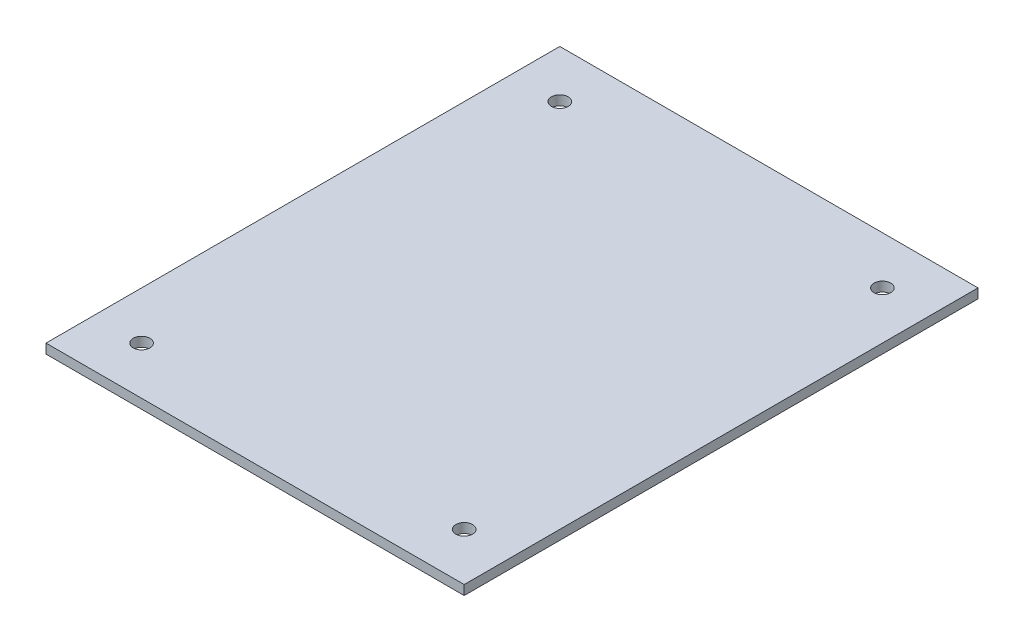
ISO-10303-21;
HEADER;
FILE_DESCRIPTION(('STEP AP214'),'2;1');
FILE_NAME('part.step','',(''),(''),'','','');
FILE_SCHEMA(('AUTOMOTIVE_DESIGN { 1 0 10303 214 1 1 1 1 }'));
ENDSEC;
DATA;
#1=APPLICATION_CONTEXT('core data for automotive mechanical design processes');
#2=APPLICATION_PROTOCOL_DEFINITION('international standard','automotive_design',2000,#1);
#3=PRODUCT_CONTEXT('',#1,'mechanical');
#4=PRODUCT('Part','Part','',(#3));
#5=PRODUCT_RELATED_PRODUCT_CATEGORY('part','',(#4));
#6=PRODUCT_DEFINITION_FORMATION('','',#4);
#7=PRODUCT_DEFINITION_CONTEXT('part definition',#1,'design');
#8=PRODUCT_DEFINITION('design','',#6,#7);
#9=PRODUCT_DEFINITION_SHAPE('','',#8);
#10=(LENGTH_UNIT() NAMED_UNIT(*) SI_UNIT(.MILLI.,.METRE.));
#11=(NAMED_UNIT(*) PLANE_ANGLE_UNIT() SI_UNIT($,.RADIAN.));
#12=(NAMED_UNIT(*) SI_UNIT($,.STERADIAN.) SOLID_ANGLE_UNIT());
#13=UNCERTAINTY_MEASURE_WITH_UNIT(LENGTH_MEASURE(1.E-05),#10,'distance_accuracy_value','');
#14=(GEOMETRIC_REPRESENTATION_CONTEXT(3) GLOBAL_UNCERTAINTY_ASSIGNED_CONTEXT((#13)) GLOBAL_UNIT_ASSIGNED_CONTEXT((#10,
#11,#12)) REPRESENTATION_CONTEXT('',''));
#15=CARTESIAN_POINT('',(0.,0.,0.));
#16=DIRECTION('',(0.,0.,1.));
#17=DIRECTION('',(1.,0.,0.));
#18=AXIS2_PLACEMENT_3D('',#15,#16,#17);
#19=CARTESIAN_POINT('',(0.,4.,0.));
#20=DIRECTION('',(0.,1.,0.));
#21=DIRECTION('',(0.,0.,1.));
#22=AXIS2_PLACEMENT_3D('',#19,#20,#21);
#23=PLANE('',#22);
#24=CARTESIAN_POINT('',(155.,4.,-185.));
#25=DIRECTION('',(0.,1.,0.));
#26=DIRECTION('',(0.,0.,1.));
#27=AXIS2_PLACEMENT_3D('',#24,#25,#26);
#28=CIRCLE('',#27,3.49999999999999);
#29=CARTESIAN_POINT('',(155.,4.,-181.5));
#30=VERTEX_POINT('',#29);
#31=EDGE_CURVE('E152',#30,#30,#28,.T.);
#32=ORIENTED_EDGE('',*,*,#31,.F.);
#33=EDGE_LOOP('',(#32));
#34=FACE_BOUND('',#33,.T.);
#35=CARTESIAN_POINT('',(20.,4.,-10.));
#36=DIRECTION('',(0.,1.,0.));
#37=DIRECTION('',(0.,0.,1.));
#38=AXIS2_PLACEMENT_3D('',#35,#36,#37);
#39=CIRCLE('',#38,3.5);
#40=CARTESIAN_POINT('',(20.,4.,-6.5));
#41=VERTEX_POINT('',#40);
#42=EDGE_CURVE('E114',#41,#41,#39,.T.);
#43=ORIENTED_EDGE('',*,*,#42,.F.);
#44=EDGE_LOOP('',(#43));
#45=FACE_BOUND('',#44,.T.);
#46=DIRECTION('',(0.,0.,1.));
#47=VECTOR('',#46,1.);
#48=CARTESIAN_POINT('',(0.,4.,-205.));
#49=LINE('',#48,#47);
#50=CARTESIAN_POINT('',(0.,4.,-205.));
#51=VERTEX_POINT('',#50);
#52=CARTESIAN_POINT('',(0.,4.,10.));
#53=VERTEX_POINT('',#52);
#54=EDGE_CURVE('E93',#51,#53,#49,.T.);
#55=ORIENTED_EDGE('',*,*,#54,.T.);
#56=DIRECTION('',(1.,0.,0.));
#57=VECTOR('',#56,1.);
#58=CARTESIAN_POINT('',(0.,4.,10.));
#59=LINE('',#58,#57);
#60=CARTESIAN_POINT('',(175.,4.,10.));
#61=VERTEX_POINT('',#60);
#62=EDGE_CURVE('E88',#53,#61,#59,.T.);
#63=ORIENTED_EDGE('',*,*,#62,.T.);
#64=DIRECTION('',(0.,0.,-1.));
#65=VECTOR('',#64,1.);
#66=CARTESIAN_POINT('',(175.,4.,-205.));
#67=LINE('',#66,#65);
#68=CARTESIAN_POINT('',(175.,4.,-205.));
#69=VERTEX_POINT('',#68);
#70=EDGE_CURVE('E91',#61,#69,#67,.T.);
#71=ORIENTED_EDGE('',*,*,#70,.T.);
#72=DIRECTION('',(-1.,0.,0.));
#73=VECTOR('',#72,1.);
#74=CARTESIAN_POINT('',(0.,4.,-205.));
#75=LINE('',#74,#73);
#76=EDGE_CURVE('E58',#69,#51,#75,.T.);
#77=ORIENTED_EDGE('',*,*,#76,.T.);
#78=EDGE_LOOP('',(#55,#63,#71,#77));
#79=FACE_BOUND('',#78,.T.);
#80=CARTESIAN_POINT('',(155.,4.,-10.));
#81=DIRECTION('',(0.,1.,0.));
#82=DIRECTION('',(0.,0.,1.));
#83=AXIS2_PLACEMENT_3D('',#80,#81,#82);
#84=CIRCLE('',#83,3.49999999999999);
#85=CARTESIAN_POINT('',(155.,4.,-6.50000000000001));
#86=VERTEX_POINT('',#85);
#87=EDGE_CURVE('E142',#86,#86,#84,.T.);
#88=ORIENTED_EDGE('',*,*,#87,.F.);
#89=EDGE_LOOP('',(#88));
#90=FACE_BOUND('',#89,.T.);
#91=CARTESIAN_POINT('',(20.,4.,-185.));
#92=DIRECTION('',(0.,1.,0.));
#93=DIRECTION('',(0.,0.,1.));
#94=AXIS2_PLACEMENT_3D('',#91,#92,#93);
#95=CIRCLE('',#94,3.5);
#96=CARTESIAN_POINT('',(20.,4.,-181.5));
#97=VERTEX_POINT('',#96);
#98=EDGE_CURVE('E160',#97,#97,#95,.T.);
#99=ORIENTED_EDGE('',*,*,#98,.F.);
#100=EDGE_LOOP('',(#99));
#101=FACE_BOUND('',#100,.T.);
#102=ADVANCED_FACE('F40',(#34,#45,#79,#90,#101),#23,.T.);
#103=CARTESIAN_POINT('',(0.,0.,0.));
#104=DIRECTION('',(0.,1.,0.));
#105=DIRECTION('',(0.,0.,1.));
#106=AXIS2_PLACEMENT_3D('',#103,#104,#105);
#107=PLANE('',#106);
#108=DIRECTION('',(0.,0.,1.));
#109=VECTOR('',#108,1.);
#110=CARTESIAN_POINT('',(0.,0.,-205.));
#111=LINE('',#110,#109);
#112=CARTESIAN_POINT('',(0.,0.,-205.));
#113=VERTEX_POINT('',#112);
#114=CARTESIAN_POINT('',(0.,0.,10.));
#115=VERTEX_POINT('',#114);
#116=EDGE_CURVE('E109',#113,#115,#111,.T.);
#117=ORIENTED_EDGE('',*,*,#116,.F.);
#118=DIRECTION('',(-1.,0.,0.));
#119=VECTOR('',#118,1.);
#120=CARTESIAN_POINT('',(0.,0.,-205.));
#121=LINE('',#120,#119);
#122=CARTESIAN_POINT('',(175.,0.,-205.));
#123=VERTEX_POINT('',#122);
#124=EDGE_CURVE('E81',#123,#113,#121,.T.);
#125=ORIENTED_EDGE('',*,*,#124,.F.);
#126=DIRECTION('',(0.,0.,-1.));
#127=VECTOR('',#126,1.);
#128=CARTESIAN_POINT('',(175.,0.,-205.));
#129=LINE('',#128,#127);
#130=CARTESIAN_POINT('',(175.,0.,10.));
#131=VERTEX_POINT('',#130);
#132=EDGE_CURVE('E75',#131,#123,#129,.T.);
#133=ORIENTED_EDGE('',*,*,#132,.F.);
#134=DIRECTION('',(1.,0.,0.));
#135=VECTOR('',#134,1.);
#136=CARTESIAN_POINT('',(0.,0.,10.));
#137=LINE('',#136,#135);
#138=EDGE_CURVE('E98',#115,#131,#137,.T.);
#139=ORIENTED_EDGE('',*,*,#138,.F.);
#140=EDGE_LOOP('',(#117,#125,#133,#139));
#141=FACE_BOUND('',#140,.T.);
#142=CARTESIAN_POINT('',(20.,0.,-10.));
#143=DIRECTION('',(0.,1.,0.));
#144=DIRECTION('',(0.,0.,1.));
#145=AXIS2_PLACEMENT_3D('',#142,#143,#144);
#146=CIRCLE('',#145,3.5);
#147=CARTESIAN_POINT('',(20.,0.,-6.5));
#148=VERTEX_POINT('',#147);
#149=EDGE_CURVE('E137',#148,#148,#146,.T.);
#150=ORIENTED_EDGE('',*,*,#149,.T.);
#151=EDGE_LOOP('',(#150));
#152=FACE_BOUND('',#151,.T.);
#153=CARTESIAN_POINT('',(155.,0.,-10.));
#154=DIRECTION('',(0.,1.,0.));
#155=DIRECTION('',(0.,0.,1.));
#156=AXIS2_PLACEMENT_3D('',#153,#154,#155);
#157=CIRCLE('',#156,3.49999999999999);
#158=CARTESIAN_POINT('',(155.,0.,-6.50000000000001));
#159=VERTEX_POINT('',#158);
#160=EDGE_CURVE('E147',#159,#159,#157,.T.);
#161=ORIENTED_EDGE('',*,*,#160,.T.);
#162=EDGE_LOOP('',(#161));
#163=FACE_BOUND('',#162,.T.);
#164=CARTESIAN_POINT('',(155.,0.,-185.));
#165=DIRECTION('',(0.,1.,0.));
#166=DIRECTION('',(0.,0.,1.));
#167=AXIS2_PLACEMENT_3D('',#164,#165,#166);
#168=CIRCLE('',#167,3.49999999999999);
#169=CARTESIAN_POINT('',(155.,0.,-181.5));
#170=VERTEX_POINT('',#169);
#171=EDGE_CURVE('E155',#170,#170,#168,.T.);
#172=ORIENTED_EDGE('',*,*,#171,.T.);
#173=EDGE_LOOP('',(#172));
#174=FACE_BOUND('',#173,.T.);
#175=CARTESIAN_POINT('',(20.,0.,-185.));
#176=DIRECTION('',(0.,1.,0.));
#177=DIRECTION('',(0.,0.,1.));
#178=AXIS2_PLACEMENT_3D('',#175,#176,#177);
#179=CIRCLE('',#178,3.5);
#180=CARTESIAN_POINT('',(20.,0.,-181.5));
#181=VERTEX_POINT('',#180);
#182=EDGE_CURVE('E163',#181,#181,#179,.T.);
#183=ORIENTED_EDGE('',*,*,#182,.T.);
#184=EDGE_LOOP('',(#183));
#185=FACE_BOUND('',#184,.T.);
#186=ADVANCED_FACE('F132',(#141,#152,#163,#174,#185),#107,.F.);
#187=CARTESIAN_POINT('',(0.,4.,-205.));
#188=DIRECTION('',(1.,0.,0.));
#189=DIRECTION('',(0.,0.,-1.));
#190=AXIS2_PLACEMENT_3D('',#187,#188,#189);
#191=PLANE('',#190);
#192=ORIENTED_EDGE('',*,*,#116,.T.);
#193=DIRECTION('',(0.,-1.,0.));
#194=VECTOR('',#193,1.);
#195=CARTESIAN_POINT('',(0.,4.,10.));
#196=LINE('',#195,#194);
#197=EDGE_CURVE('E12',#53,#115,#196,.T.);
#198=ORIENTED_EDGE('',*,*,#197,.F.);
#199=ORIENTED_EDGE('',*,*,#54,.F.);
#200=DIRECTION('',(0.,-1.,0.));
#201=VECTOR('',#200,1.);
#202=CARTESIAN_POINT('',(0.,4.,-205.));
#203=LINE('',#202,#201);
#204=EDGE_CURVE('E105',#51,#113,#203,.T.);
#205=ORIENTED_EDGE('',*,*,#204,.T.);
#206=EDGE_LOOP('',(#192,#198,#199,#205));
#207=FACE_BOUND('',#206,.T.);
#208=ADVANCED_FACE('F42',(#207),#191,.F.);
#209=CARTESIAN_POINT('',(0.,4.,10.));
#210=DIRECTION('',(0.,0.,-1.));
#211=DIRECTION('',(-1.,0.,0.));
#212=AXIS2_PLACEMENT_3D('',#209,#210,#211);
#213=PLANE('',#212);
#214=ORIENTED_EDGE('',*,*,#138,.T.);
#215=DIRECTION('',(0.,-1.,0.));
#216=VECTOR('',#215,1.);
#217=CARTESIAN_POINT('',(175.,4.,10.));
#218=LINE('',#217,#216);
#219=EDGE_CURVE('E50',#61,#131,#218,.T.);
#220=ORIENTED_EDGE('',*,*,#219,.F.);
#221=ORIENTED_EDGE('',*,*,#62,.F.);
#222=ORIENTED_EDGE('',*,*,#197,.T.);
#223=EDGE_LOOP('',(#214,#220,#221,#222));
#224=FACE_BOUND('',#223,.T.);
#225=ADVANCED_FACE('F97',(#224),#213,.F.);
#226=CARTESIAN_POINT('',(175.,4.,-205.));
#227=DIRECTION('',(-1.,0.,0.));
#228=DIRECTION('',(0.,0.,1.));
#229=AXIS2_PLACEMENT_3D('',#226,#227,#228);
#230=PLANE('',#229);
#231=ORIENTED_EDGE('',*,*,#132,.T.);
#232=DIRECTION('',(0.,-1.,0.));
#233=VECTOR('',#232,1.);
#234=CARTESIAN_POINT('',(175.,4.,-205.));
#235=LINE('',#234,#233);
#236=EDGE_CURVE('E100',#69,#123,#235,.T.);
#237=ORIENTED_EDGE('',*,*,#236,.F.);
#238=ORIENTED_EDGE('',*,*,#70,.F.);
#239=ORIENTED_EDGE('',*,*,#219,.T.);
#240=EDGE_LOOP('',(#231,#237,#238,#239));
#241=FACE_BOUND('',#240,.T.);
#242=ADVANCED_FACE('F101',(#241),#230,.F.);
#243=CARTESIAN_POINT('',(0.,4.,-205.));
#244=DIRECTION('',(0.,0.,1.));
#245=DIRECTION('',(1.,0.,0.));
#246=AXIS2_PLACEMENT_3D('',#243,#244,#245);
#247=PLANE('',#246);
#248=ORIENTED_EDGE('',*,*,#124,.T.);
#249=ORIENTED_EDGE('',*,*,#204,.F.);
#250=ORIENTED_EDGE('',*,*,#76,.F.);
#251=ORIENTED_EDGE('',*,*,#236,.T.);
#252=EDGE_LOOP('',(#248,#249,#250,#251));
#253=FACE_BOUND('',#252,.T.);
#254=ADVANCED_FACE('F129',(#253),#247,.F.);
#255=CARTESIAN_POINT('',(20.,4.,-10.));
#256=DIRECTION('',(0.,-1.,0.));
#257=DIRECTION('',(0.,0.,-1.));
#258=AXIS2_PLACEMENT_3D('',#255,#256,#257);
#259=CYLINDRICAL_SURFACE('',#258,3.5);
#260=ORIENTED_EDGE('',*,*,#42,.T.);
#261=EDGE_LOOP('',(#260));
#262=FACE_BOUND('',#261,.T.);
#263=ORIENTED_EDGE('',*,*,#149,.F.);
#264=EDGE_LOOP('',(#263));
#265=FACE_BOUND('',#264,.T.);
#266=ADVANCED_FACE('F185',(#262,#265),#259,.F.);
#267=CARTESIAN_POINT('',(155.,4.,-10.));
#268=DIRECTION('',(0.,-1.,0.));
#269=DIRECTION('',(0.,0.,-1.));
#270=AXIS2_PLACEMENT_3D('',#267,#268,#269);
#271=CYLINDRICAL_SURFACE('',#270,3.49999999999999);
#272=ORIENTED_EDGE('',*,*,#87,.T.);
#273=EDGE_LOOP('',(#272));
#274=FACE_BOUND('',#273,.T.);
#275=ORIENTED_EDGE('',*,*,#160,.F.);
#276=EDGE_LOOP('',(#275));
#277=FACE_BOUND('',#276,.T.);
#278=ADVANCED_FACE('F231',(#274,#277),#271,.F.);
#279=CARTESIAN_POINT('',(155.,4.,-185.));
#280=DIRECTION('',(0.,-1.,0.));
#281=DIRECTION('',(0.,0.,-1.));
#282=AXIS2_PLACEMENT_3D('',#279,#280,#281);
#283=CYLINDRICAL_SURFACE('',#282,3.49999999999999);
#284=ORIENTED_EDGE('',*,*,#31,.T.);
#285=EDGE_LOOP('',(#284));
#286=FACE_BOUND('',#285,.T.);
#287=ORIENTED_EDGE('',*,*,#171,.F.);
#288=EDGE_LOOP('',(#287));
#289=FACE_BOUND('',#288,.T.);
#290=ADVANCED_FACE('F239',(#286,#289),#283,.F.);
#291=CARTESIAN_POINT('',(20.,4.,-185.));
#292=DIRECTION('',(0.,-1.,0.));
#293=DIRECTION('',(0.,0.,-1.));
#294=AXIS2_PLACEMENT_3D('',#291,#292,#293);
#295=CYLINDRICAL_SURFACE('',#294,3.5);
#296=ORIENTED_EDGE('',*,*,#98,.T.);
#297=EDGE_LOOP('',(#296));
#298=FACE_BOUND('',#297,.T.);
#299=ORIENTED_EDGE('',*,*,#182,.F.);
#300=EDGE_LOOP('',(#299));
#301=FACE_BOUND('',#300,.T.);
#302=ADVANCED_FACE('F172',(#298,#301),#295,.F.);
#303=CLOSED_SHELL('',(#102,#186,#208,#225,#242,#254,#266,#278,#290,#302));
#304=MANIFOLD_SOLID_BREP('B2',#303);
#305=ADVANCED_BREP_SHAPE_REPRESENTATION('',(#18,#304),#14);
#306=SHAPE_DEFINITION_REPRESENTATION(#9,#305);
ENDSEC;
END-ISO-10303-21;
